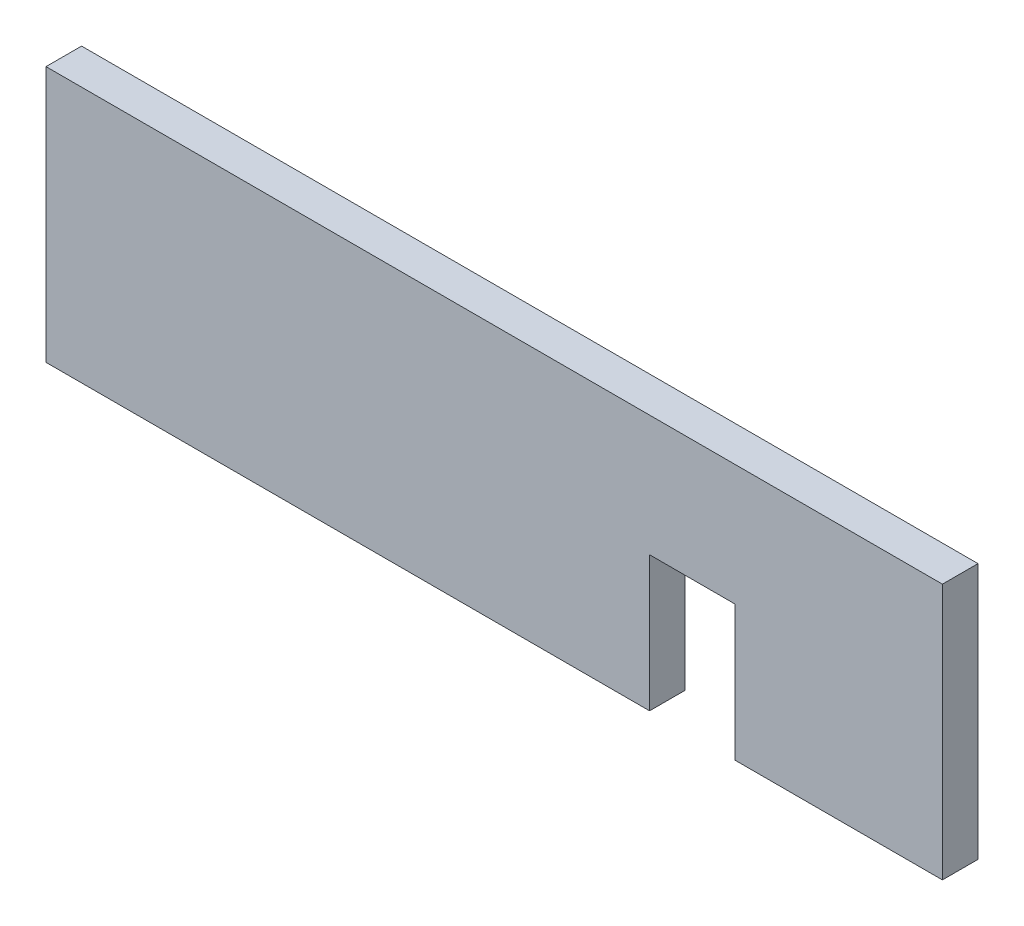
ISO-10303-21;
HEADER;
FILE_DESCRIPTION(('STEP AP214'),'2;1');
FILE_NAME('part.step','',(''),(''),'','','');
FILE_SCHEMA(('AUTOMOTIVE_DESIGN { 1 0 10303 214 1 1 1 1 }'));
ENDSEC;
DATA;
#1=APPLICATION_CONTEXT('core data for automotive mechanical design processes');
#2=APPLICATION_PROTOCOL_DEFINITION('international standard','automotive_design',2000,#1);
#3=PRODUCT_CONTEXT('',#1,'mechanical');
#4=PRODUCT('Part','Part','',(#3));
#5=PRODUCT_RELATED_PRODUCT_CATEGORY('part','',(#4));
#6=PRODUCT_DEFINITION_FORMATION('','',#4);
#7=PRODUCT_DEFINITION_CONTEXT('part definition',#1,'design');
#8=PRODUCT_DEFINITION('design','',#6,#7);
#9=PRODUCT_DEFINITION_SHAPE('','',#8);
#10=(LENGTH_UNIT() NAMED_UNIT(*) SI_UNIT(.MILLI.,.METRE.));
#11=(NAMED_UNIT(*) PLANE_ANGLE_UNIT() SI_UNIT($,.RADIAN.));
#12=(NAMED_UNIT(*) SI_UNIT($,.STERADIAN.) SOLID_ANGLE_UNIT());
#13=UNCERTAINTY_MEASURE_WITH_UNIT(LENGTH_MEASURE(1.E-05),#10,'distance_accuracy_value','');
#14=(GEOMETRIC_REPRESENTATION_CONTEXT(3) GLOBAL_UNCERTAINTY_ASSIGNED_CONTEXT((#13)) GLOBAL_UNIT_ASSIGNED_CONTEXT((#10,
#11,#12)) REPRESENTATION_CONTEXT('',''));
#15=CARTESIAN_POINT('',(0.,0.,0.));
#16=DIRECTION('',(0.,0.,1.));
#17=DIRECTION('',(1.,0.,0.));
#18=AXIS2_PLACEMENT_3D('',#15,#16,#17);
#19=CARTESIAN_POINT('',(-64.862738222395,0.612918823050545,1.5875));
#20=DIRECTION('',(0.,1.,0.));
#21=DIRECTION('',(0.,0.,1.));
#22=AXIS2_PLACEMENT_3D('',#19,#20,#21);
#23=PLANE('',#22);
#24=DIRECTION('',(1.,0.,0.));
#25=VECTOR('',#24,1.);
#26=CARTESIAN_POINT('',(-64.862738222395,0.612918823050545,1.5875));
#27=LINE('',#26,#25);
#28=CARTESIAN_POINT('',(-34.1209311043507,0.612918823050547,1.5875));
#29=VERTEX_POINT('',#28);
#30=CARTESIAN_POINT('',(-24.862738222395,0.612918823050545,1.5875));
#31=VERTEX_POINT('',#30);
#32=EDGE_CURVE('E135',#29,#31,#27,.T.);
#33=ORIENTED_EDGE('',*,*,#32,.F.);
#34=DIRECTION('',(0.,0.,-1.));
#35=VECTOR('',#34,1.);
#36=CARTESIAN_POINT('',(-34.1209311043507,0.612918823050545,1.5875));
#37=LINE('',#36,#35);
#38=CARTESIAN_POINT('',(-34.1209311043507,0.612918823050545,0.));
#39=VERTEX_POINT('',#38);
#40=EDGE_CURVE('E113',#29,#39,#37,.T.);
#41=ORIENTED_EDGE('',*,*,#40,.T.);
#42=DIRECTION('',(1.,0.,0.));
#43=VECTOR('',#42,1.);
#44=CARTESIAN_POINT('',(-64.862738222395,0.612918823050545,0.));
#45=LINE('',#44,#43);
#46=CARTESIAN_POINT('',(-24.862738222395,0.612918823050545,0.));
#47=VERTEX_POINT('',#46);
#48=EDGE_CURVE('E143',#39,#47,#45,.T.);
#49=ORIENTED_EDGE('',*,*,#48,.T.);
#50=DIRECTION('',(0.,0.,-1.));
#51=VECTOR('',#50,1.);
#52=CARTESIAN_POINT('',(-24.862738222395,0.612918823050545,1.5875));
#53=LINE('',#52,#51);
#54=EDGE_CURVE('E153',#31,#47,#53,.T.);
#55=ORIENTED_EDGE('',*,*,#54,.F.);
#56=EDGE_LOOP('',(#33,#41,#49,#55));
#57=FACE_BOUND('',#56,.T.);
#58=ADVANCED_FACE('F32',(#57),#23,.F.);
#59=CARTESIAN_POINT('',(-64.862738222395,12.0429188230505,1.5875));
#60=DIRECTION('',(1.,0.,0.));
#61=DIRECTION('',(0.,0.,-1.));
#62=AXIS2_PLACEMENT_3D('',#59,#60,#61);
#63=PLANE('',#62);
#64=DIRECTION('',(0.,-1.,0.));
#65=VECTOR('',#64,1.);
#66=CARTESIAN_POINT('',(-64.862738222395,12.0429188230505,0.));
#67=LINE('',#66,#65);
#68=CARTESIAN_POINT('',(-64.862738222395,12.0429188230505,0.));
#69=VERTEX_POINT('',#68);
#70=CARTESIAN_POINT('',(-64.862738222395,0.612918823050545,0.));
#71=VERTEX_POINT('',#70);
#72=EDGE_CURVE('E132',#69,#71,#67,.T.);
#73=ORIENTED_EDGE('',*,*,#72,.T.);
#74=DIRECTION('',(0.,0.,-1.));
#75=VECTOR('',#74,1.);
#76=CARTESIAN_POINT('',(-64.862738222395,0.612918823050545,1.5875));
#77=LINE('',#76,#75);
#78=CARTESIAN_POINT('',(-64.862738222395,0.612918823050545,1.5875));
#79=VERTEX_POINT('',#78);
#80=EDGE_CURVE('E156',#79,#71,#77,.T.);
#81=ORIENTED_EDGE('',*,*,#80,.F.);
#82=DIRECTION('',(0.,-1.,0.));
#83=VECTOR('',#82,1.);
#84=CARTESIAN_POINT('',(-64.862738222395,12.0429188230505,1.5875));
#85=LINE('',#84,#83);
#86=CARTESIAN_POINT('',(-64.862738222395,12.0429188230505,1.5875));
#87=VERTEX_POINT('',#86);
#88=EDGE_CURVE('E133',#87,#79,#85,.T.);
#89=ORIENTED_EDGE('',*,*,#88,.F.);
#90=DIRECTION('',(0.,0.,-1.));
#91=VECTOR('',#90,1.);
#92=CARTESIAN_POINT('',(-64.862738222395,12.0429188230505,1.5875));
#93=LINE('',#92,#91);
#94=EDGE_CURVE('E140',#87,#69,#93,.T.);
#95=ORIENTED_EDGE('',*,*,#94,.T.);
#96=EDGE_LOOP('',(#73,#81,#89,#95));
#97=FACE_BOUND('',#96,.T.);
#98=ADVANCED_FACE('F34',(#97),#63,.F.);
#99=CARTESIAN_POINT('',(-37.9309311043507,0.612918823050545,0.));
#100=VERTEX_POINT('',#99);
#101=EDGE_CURVE('E144',#71,#100,#45,.T.);
#102=ORIENTED_EDGE('',*,*,#101,.T.);
#103=DIRECTION('',(0.,0.,1.));
#104=VECTOR('',#103,1.);
#105=CARTESIAN_POINT('',(-37.9309311043507,0.612918823050545,1.5875));
#106=LINE('',#105,#104);
#107=CARTESIAN_POINT('',(-37.9309311043507,0.612918823050545,1.5875));
#108=VERTEX_POINT('',#107);
#109=EDGE_CURVE('E128',#100,#108,#106,.T.);
#110=ORIENTED_EDGE('',*,*,#109,.T.);
#111=EDGE_CURVE('E85',#79,#108,#27,.T.);
#112=ORIENTED_EDGE('',*,*,#111,.F.);
#113=ORIENTED_EDGE('',*,*,#80,.T.);
#114=EDGE_LOOP('',(#102,#110,#112,#113));
#115=FACE_BOUND('',#114,.T.);
#116=ADVANCED_FACE('F164',(#115),#23,.F.);
#117=CARTESIAN_POINT('',(-24.862738222395,12.0429188230505,1.5875));
#118=DIRECTION('',(-1.,0.,0.));
#119=DIRECTION('',(0.,-1.,0.));
#120=AXIS2_PLACEMENT_3D('',#117,#118,#119);
#121=PLANE('',#120);
#122=DIRECTION('',(0.,1.,0.));
#123=VECTOR('',#122,1.);
#124=CARTESIAN_POINT('',(-24.862738222395,12.0429188230505,0.));
#125=LINE('',#124,#123);
#126=CARTESIAN_POINT('',(-24.862738222395,12.0429188230505,0.));
#127=VERTEX_POINT('',#126);
#128=EDGE_CURVE('E147',#47,#127,#125,.T.);
#129=ORIENTED_EDGE('',*,*,#128,.T.);
#130=DIRECTION('',(0.,0.,-1.));
#131=VECTOR('',#130,1.);
#132=CARTESIAN_POINT('',(-24.862738222395,12.0429188230505,1.5875));
#133=LINE('',#132,#131);
#134=CARTESIAN_POINT('',(-24.862738222395,12.0429188230505,1.5875));
#135=VERTEX_POINT('',#134);
#136=EDGE_CURVE('E151',#135,#127,#133,.T.);
#137=ORIENTED_EDGE('',*,*,#136,.F.);
#138=DIRECTION('',(0.,1.,0.));
#139=VECTOR('',#138,1.);
#140=CARTESIAN_POINT('',(-24.862738222395,12.0429188230505,1.5875));
#141=LINE('',#140,#139);
#142=EDGE_CURVE('E137',#31,#135,#141,.T.);
#143=ORIENTED_EDGE('',*,*,#142,.F.);
#144=ORIENTED_EDGE('',*,*,#54,.T.);
#145=EDGE_LOOP('',(#129,#137,#143,#144));
#146=FACE_BOUND('',#145,.T.);
#147=ADVANCED_FACE('F171',(#146),#121,.F.);
#148=CARTESIAN_POINT('',(-64.862738222395,12.0429188230505,1.5875));
#149=DIRECTION('',(0.,-1.,0.));
#150=DIRECTION('',(0.,0.,-1.));
#151=AXIS2_PLACEMENT_3D('',#148,#149,#150);
#152=PLANE('',#151);
#153=DIRECTION('',(-1.,0.,0.));
#154=VECTOR('',#153,1.);
#155=CARTESIAN_POINT('',(-64.862738222395,12.0429188230505,0.));
#156=LINE('',#155,#154);
#157=EDGE_CURVE('E77',#127,#69,#156,.T.);
#158=ORIENTED_EDGE('',*,*,#157,.T.);
#159=ORIENTED_EDGE('',*,*,#94,.F.);
#160=DIRECTION('',(-1.,0.,0.));
#161=VECTOR('',#160,1.);
#162=CARTESIAN_POINT('',(-64.862738222395,12.0429188230505,1.5875));
#163=LINE('',#162,#161);
#164=EDGE_CURVE('E56',#135,#87,#163,.T.);
#165=ORIENTED_EDGE('',*,*,#164,.F.);
#166=ORIENTED_EDGE('',*,*,#136,.T.);
#167=EDGE_LOOP('',(#158,#159,#165,#166));
#168=FACE_BOUND('',#167,.T.);
#169=ADVANCED_FACE('F174',(#168),#152,.F.);
#170=CARTESIAN_POINT('',(-64.862738222395,0.612918823050545,1.5875));
#171=DIRECTION('',(0.,0.,1.));
#172=DIRECTION('',(1.,0.,0.));
#173=AXIS2_PLACEMENT_3D('',#170,#171,#172);
#174=PLANE('',#173);
#175=DIRECTION('',(0.,1.,0.));
#176=VECTOR('',#175,1.);
#177=CARTESIAN_POINT('',(-34.1209311043507,6.64616020775277,1.5875));
#178=LINE('',#177,#176);
#179=CARTESIAN_POINT('',(-34.1209311043507,6.64616020775277,1.5875));
#180=VERTEX_POINT('',#179);
#181=EDGE_CURVE('E108',#29,#180,#178,.T.);
#182=ORIENTED_EDGE('',*,*,#181,.F.);
#183=ORIENTED_EDGE('',*,*,#32,.T.);
#184=ORIENTED_EDGE('',*,*,#142,.T.);
#185=ORIENTED_EDGE('',*,*,#164,.T.);
#186=ORIENTED_EDGE('',*,*,#88,.T.);
#187=ORIENTED_EDGE('',*,*,#111,.T.);
#188=DIRECTION('',(0.,-1.,0.));
#189=VECTOR('',#188,1.);
#190=CARTESIAN_POINT('',(-37.9309311043507,6.64616020775277,1.5875));
#191=LINE('',#190,#189);
#192=CARTESIAN_POINT('',(-37.9309311043507,6.64616020775277,1.5875));
#193=VERTEX_POINT('',#192);
#194=EDGE_CURVE('E122',#193,#108,#191,.T.);
#195=ORIENTED_EDGE('',*,*,#194,.F.);
#196=DIRECTION('',(-1.,0.,0.));
#197=VECTOR('',#196,1.);
#198=CARTESIAN_POINT('',(-34.1209311043507,6.64616020775277,1.5875));
#199=LINE('',#198,#197);
#200=EDGE_CURVE('E116',#180,#193,#199,.T.);
#201=ORIENTED_EDGE('',*,*,#200,.F.);
#202=EDGE_LOOP('',(#182,#183,#184,#185,#186,#187,#195,#201));
#203=FACE_BOUND('',#202,.T.);
#204=ADVANCED_FACE('F124',(#203),#174,.T.);
#205=CARTESIAN_POINT('',(-64.862738222395,0.612918823050545,0.));
#206=DIRECTION('',(0.,0.,1.));
#207=DIRECTION('',(1.,0.,0.));
#208=AXIS2_PLACEMENT_3D('',#205,#206,#207);
#209=PLANE('',#208);
#210=ORIENTED_EDGE('',*,*,#48,.F.);
#211=DIRECTION('',(0.,1.,0.));
#212=VECTOR('',#211,1.);
#213=CARTESIAN_POINT('',(-34.1209311043507,0.612918823050545,0.));
#214=LINE('',#213,#212);
#215=CARTESIAN_POINT('',(-34.1209311043507,6.64616020775277,0.));
#216=VERTEX_POINT('',#215);
#217=EDGE_CURVE('E11',#39,#216,#214,.T.);
#218=ORIENTED_EDGE('',*,*,#217,.T.);
#219=DIRECTION('',(-1.,0.,0.));
#220=VECTOR('',#219,1.);
#221=CARTESIAN_POINT('',(-64.862738222395,6.64616020775276,0.));
#222=LINE('',#221,#220);
#223=CARTESIAN_POINT('',(-37.9309311043507,6.64616020775277,0.));
#224=VERTEX_POINT('',#223);
#225=EDGE_CURVE('E121',#216,#224,#222,.T.);
#226=ORIENTED_EDGE('',*,*,#225,.T.);
#227=DIRECTION('',(0.,-1.,0.));
#228=VECTOR('',#227,1.);
#229=CARTESIAN_POINT('',(-37.9309311043507,0.612918823050545,0.));
#230=LINE('',#229,#228);
#231=EDGE_CURVE('E40',#224,#100,#230,.T.);
#232=ORIENTED_EDGE('',*,*,#231,.T.);
#233=ORIENTED_EDGE('',*,*,#101,.F.);
#234=ORIENTED_EDGE('',*,*,#72,.F.);
#235=ORIENTED_EDGE('',*,*,#157,.F.);
#236=ORIENTED_EDGE('',*,*,#128,.F.);
#237=EDGE_LOOP('',(#210,#218,#226,#232,#233,#234,#235,#236));
#238=FACE_BOUND('',#237,.T.);
#239=ADVANCED_FACE('F161',(#238),#209,.F.);
#240=CARTESIAN_POINT('',(-34.1209311043507,6.64616020775277,-0.9525));
#241=DIRECTION('',(1.,0.,0.));
#242=DIRECTION('',(0.,0.,-1.));
#243=AXIS2_PLACEMENT_3D('',#240,#241,#242);
#244=PLANE('',#243);
#245=ORIENTED_EDGE('',*,*,#181,.T.);
#246=DIRECTION('',(0.,0.,1.));
#247=VECTOR('',#246,1.);
#248=CARTESIAN_POINT('',(-34.1209311043507,6.64616020775277,-0.9525));
#249=LINE('',#248,#247);
#250=EDGE_CURVE('E111',#216,#180,#249,.T.);
#251=ORIENTED_EDGE('',*,*,#250,.F.);
#252=ORIENTED_EDGE('',*,*,#217,.F.);
#253=ORIENTED_EDGE('',*,*,#40,.F.);
#254=EDGE_LOOP('',(#245,#251,#252,#253));
#255=FACE_BOUND('',#254,.T.);
#256=ADVANCED_FACE('F110',(#255),#244,.F.);
#257=CARTESIAN_POINT('',(-37.9309311043507,6.64616020775277,-0.9525));
#258=DIRECTION('',(-1.,0.,0.));
#259=DIRECTION('',(0.,0.,1.));
#260=AXIS2_PLACEMENT_3D('',#257,#258,#259);
#261=PLANE('',#260);
#262=ORIENTED_EDGE('',*,*,#231,.F.);
#263=DIRECTION('',(0.,0.,1.));
#264=VECTOR('',#263,1.);
#265=CARTESIAN_POINT('',(-37.9309311043507,6.64616020775277,-0.9525));
#266=LINE('',#265,#264);
#267=EDGE_CURVE('E47',#224,#193,#266,.T.);
#268=ORIENTED_EDGE('',*,*,#267,.T.);
#269=ORIENTED_EDGE('',*,*,#194,.T.);
#270=ORIENTED_EDGE('',*,*,#109,.F.);
#271=EDGE_LOOP('',(#262,#268,#269,#270));
#272=FACE_BOUND('',#271,.T.);
#273=ADVANCED_FACE('F209',(#272),#261,.F.);
#274=CARTESIAN_POINT('',(-34.1209311043507,6.64616020775277,-0.9525));
#275=DIRECTION('',(0.,1.,0.));
#276=DIRECTION('',(-1.,0.,0.));
#277=AXIS2_PLACEMENT_3D('',#274,#275,#276);
#278=PLANE('',#277);
#279=ORIENTED_EDGE('',*,*,#250,.T.);
#280=ORIENTED_EDGE('',*,*,#200,.T.);
#281=ORIENTED_EDGE('',*,*,#267,.F.);
#282=ORIENTED_EDGE('',*,*,#225,.F.);
#283=EDGE_LOOP('',(#279,#280,#281,#282));
#284=FACE_BOUND('',#283,.T.);
#285=ADVANCED_FACE('F118',(#284),#278,.F.);
#286=CLOSED_SHELL('',(#58,#98,#116,#147,#169,#204,#239,#256,#273,#285));
#287=MANIFOLD_SOLID_BREP('B2',#286);
#288=ADVANCED_BREP_SHAPE_REPRESENTATION('',(#18,#287),#14);
#289=SHAPE_DEFINITION_REPRESENTATION(#9,#288);
ENDSEC;
END-ISO-10303-21;
